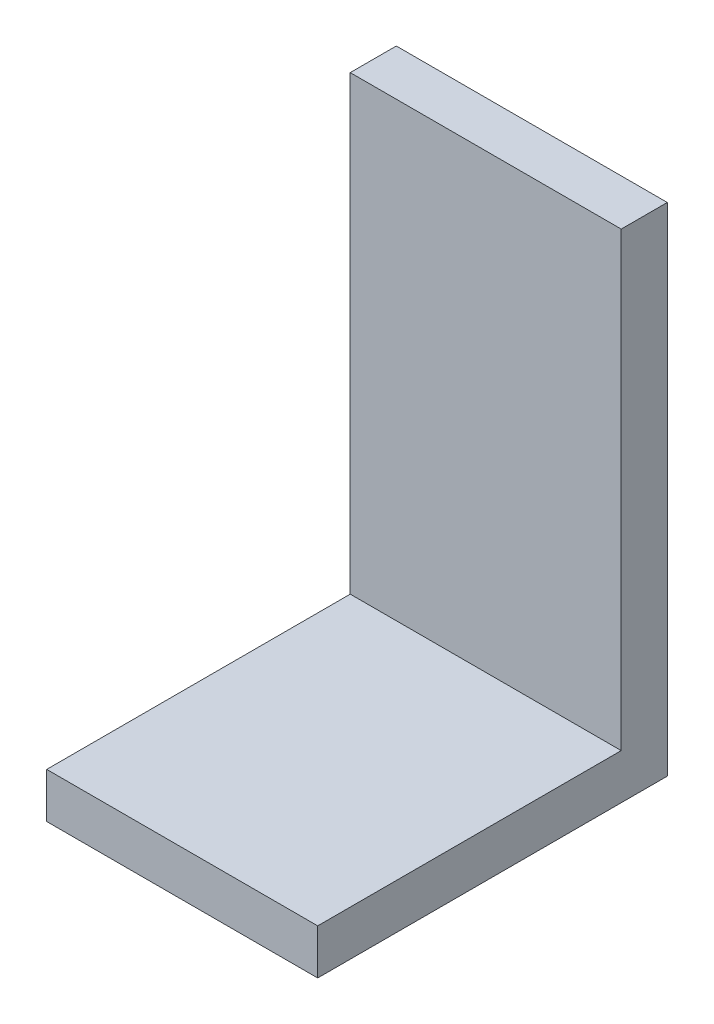
ISO-10303-21;
HEADER;
FILE_DESCRIPTION(('STEP AP214'),'2;1');
FILE_NAME('part.step','',(''),(''),'','','');
FILE_SCHEMA(('AUTOMOTIVE_DESIGN { 1 0 10303 214 1 1 1 1 }'));
ENDSEC;
DATA;
#1=APPLICATION_CONTEXT('core data for automotive mechanical design processes');
#2=APPLICATION_PROTOCOL_DEFINITION('international standard','automotive_design',2000,#1);
#3=PRODUCT_CONTEXT('',#1,'mechanical');
#4=PRODUCT('Part','Part','',(#3));
#5=PRODUCT_RELATED_PRODUCT_CATEGORY('part','',(#4));
#6=PRODUCT_DEFINITION_FORMATION('','',#4);
#7=PRODUCT_DEFINITION_CONTEXT('part definition',#1,'design');
#8=PRODUCT_DEFINITION('design','',#6,#7);
#9=PRODUCT_DEFINITION_SHAPE('','',#8);
#10=(LENGTH_UNIT() NAMED_UNIT(*) SI_UNIT(.MILLI.,.METRE.));
#11=(NAMED_UNIT(*) PLANE_ANGLE_UNIT() SI_UNIT($,.RADIAN.));
#12=(NAMED_UNIT(*) SI_UNIT($,.STERADIAN.) SOLID_ANGLE_UNIT());
#13=UNCERTAINTY_MEASURE_WITH_UNIT(LENGTH_MEASURE(1.E-05),#10,'distance_accuracy_value','');
#14=(GEOMETRIC_REPRESENTATION_CONTEXT(3) GLOBAL_UNCERTAINTY_ASSIGNED_CONTEXT((#13)) GLOBAL_UNIT_ASSIGNED_CONTEXT((#10,
#11,#12)) REPRESENTATION_CONTEXT('',''));
#15=CARTESIAN_POINT('',(0.,0.,0.));
#16=DIRECTION('',(0.,0.,1.));
#17=DIRECTION('',(1.,0.,0.));
#18=AXIS2_PLACEMENT_3D('',#15,#16,#17);
#19=CARTESIAN_POINT('',(-0.1,-4.55,0.));
#20=DIRECTION('',(1.,0.,0.));
#21=DIRECTION('',(0.,0.,1.));
#22=AXIS2_PLACEMENT_3D('',#19,#20,#21);
#23=PLANE('',#22);
#24=DIRECTION('',(0.,-1.,0.));
#25=VECTOR('',#24,1.);
#26=CARTESIAN_POINT('',(-0.1,-4.,0.));
#27=LINE('',#26,#25);
#28=CARTESIAN_POINT('',(-0.1,-4.,0.));
#29=VERTEX_POINT('',#28);
#30=CARTESIAN_POINT('',(-0.1,-4.55,0.));
#31=VERTEX_POINT('',#30);
#32=EDGE_CURVE('E11',#29,#31,#27,.T.);
#33=ORIENTED_EDGE('',*,*,#32,.F.);
#34=DIRECTION('',(0.,0.,-1.));
#35=VECTOR('',#34,1.);
#36=CARTESIAN_POINT('',(-0.1,-4.,0.051));
#37=LINE('',#36,#35);
#38=CARTESIAN_POINT('',(-0.1,-4.,0.051));
#39=VERTEX_POINT('',#38);
#40=EDGE_CURVE('E24',#39,#29,#37,.T.);
#41=ORIENTED_EDGE('',*,*,#40,.F.);
#42=DIRECTION('',(0.,1.,0.));
#43=VECTOR('',#42,1.);
#44=CARTESIAN_POINT('',(-0.1,-4.5,0.051));
#45=LINE('',#44,#43);
#46=CARTESIAN_POINT('',(-0.1,-4.5,0.051));
#47=VERTEX_POINT('',#46);
#48=EDGE_CURVE('E87',#47,#39,#45,.T.);
#49=ORIENTED_EDGE('',*,*,#48,.F.);
#50=DIRECTION('',(0.,0.,-1.));
#51=VECTOR('',#50,1.);
#52=CARTESIAN_POINT('',(-0.1,-4.5,0.387));
#53=LINE('',#52,#51);
#54=CARTESIAN_POINT('',(-0.1,-4.5,0.387));
#55=VERTEX_POINT('',#54);
#56=EDGE_CURVE('E114',#55,#47,#53,.T.);
#57=ORIENTED_EDGE('',*,*,#56,.F.);
#58=DIRECTION('',(0.,1.,0.));
#59=VECTOR('',#58,1.);
#60=CARTESIAN_POINT('',(-0.1,-4.55,0.387));
#61=LINE('',#60,#59);
#62=CARTESIAN_POINT('',(-0.1,-4.55,0.387));
#63=VERTEX_POINT('',#62);
#64=EDGE_CURVE('E111',#63,#55,#61,.T.);
#65=ORIENTED_EDGE('',*,*,#64,.F.);
#66=DIRECTION('',(0.,0.,1.));
#67=VECTOR('',#66,1.);
#68=CARTESIAN_POINT('',(-0.1,-4.55,0.));
#69=LINE('',#68,#67);
#70=EDGE_CURVE('E108',#31,#63,#69,.T.);
#71=ORIENTED_EDGE('',*,*,#70,.F.);
#72=EDGE_LOOP('',(#33,#41,#49,#57,#65,#71));
#73=FACE_BOUND('',#72,.T.);
#74=ADVANCED_FACE('F17',(#73),#23,.T.);
#75=CARTESIAN_POINT('',(-0.4,-4.,0.));
#76=DIRECTION('',(-1.,0.,0.));
#77=DIRECTION('',(0.,0.,1.));
#78=AXIS2_PLACEMENT_3D('',#75,#76,#77);
#79=PLANE('',#78);
#80=DIRECTION('',(0.,1.,0.));
#81=VECTOR('',#80,1.);
#82=CARTESIAN_POINT('',(-0.4,-4.55,0.));
#83=LINE('',#82,#81);
#84=CARTESIAN_POINT('',(-0.4,-4.55,0.));
#85=VERTEX_POINT('',#84);
#86=CARTESIAN_POINT('',(-0.4,-4.,0.));
#87=VERTEX_POINT('',#86);
#88=EDGE_CURVE('E106',#85,#87,#83,.T.);
#89=ORIENTED_EDGE('',*,*,#88,.F.);
#90=DIRECTION('',(0.,0.,-1.));
#91=VECTOR('',#90,1.);
#92=CARTESIAN_POINT('',(-0.4,-4.55,0.387));
#93=LINE('',#92,#91);
#94=CARTESIAN_POINT('',(-0.4,-4.55,0.387));
#95=VERTEX_POINT('',#94);
#96=EDGE_CURVE('E103',#95,#85,#93,.T.);
#97=ORIENTED_EDGE('',*,*,#96,.F.);
#98=DIRECTION('',(0.,-1.,0.));
#99=VECTOR('',#98,1.);
#100=CARTESIAN_POINT('',(-0.4,-4.5,0.387));
#101=LINE('',#100,#99);
#102=CARTESIAN_POINT('',(-0.4,-4.5,0.387));
#103=VERTEX_POINT('',#102);
#104=EDGE_CURVE('E100',#103,#95,#101,.T.);
#105=ORIENTED_EDGE('',*,*,#104,.F.);
#106=DIRECTION('',(0.,0.,1.));
#107=VECTOR('',#106,1.);
#108=CARTESIAN_POINT('',(-0.4,-4.5,0.051));
#109=LINE('',#108,#107);
#110=CARTESIAN_POINT('',(-0.4,-4.5,0.051));
#111=VERTEX_POINT('',#110);
#112=EDGE_CURVE('E72',#111,#103,#109,.T.);
#113=ORIENTED_EDGE('',*,*,#112,.F.);
#114=DIRECTION('',(0.,-1.,0.));
#115=VECTOR('',#114,1.);
#116=CARTESIAN_POINT('',(-0.4,-4.,0.051));
#117=LINE('',#116,#115);
#118=CARTESIAN_POINT('',(-0.4,-4.,0.051));
#119=VERTEX_POINT('',#118);
#120=EDGE_CURVE('E66',#119,#111,#117,.T.);
#121=ORIENTED_EDGE('',*,*,#120,.F.);
#122=DIRECTION('',(0.,0.,1.));
#123=VECTOR('',#122,1.);
#124=CARTESIAN_POINT('',(-0.4,-4.,0.));
#125=LINE('',#124,#123);
#126=EDGE_CURVE('E69',#87,#119,#125,.T.);
#127=ORIENTED_EDGE('',*,*,#126,.F.);
#128=EDGE_LOOP('',(#89,#97,#105,#113,#121,#127));
#129=FACE_BOUND('',#128,.T.);
#130=ADVANCED_FACE('F68',(#129),#79,.T.);
#131=CARTESIAN_POINT('',(-0.1,-4.55,0.387));
#132=DIRECTION('',(0.,0.,1.));
#133=DIRECTION('',(0.,1.,0.));
#134=AXIS2_PLACEMENT_3D('',#131,#132,#133);
#135=PLANE('',#134);
#136=ORIENTED_EDGE('',*,*,#64,.T.);
#137=DIRECTION('',(1.,0.,0.));
#138=VECTOR('',#137,1.);
#139=CARTESIAN_POINT('',(-0.4,-4.5,0.387));
#140=LINE('',#139,#138);
#141=EDGE_CURVE('E83',#103,#55,#140,.T.);
#142=ORIENTED_EDGE('',*,*,#141,.F.);
#143=ORIENTED_EDGE('',*,*,#104,.T.);
#144=DIRECTION('',(-1.,0.,0.));
#145=VECTOR('',#144,1.);
#146=CARTESIAN_POINT('',(-0.1,-4.55,0.387));
#147=LINE('',#146,#145);
#148=EDGE_CURVE('E88',#63,#95,#147,.T.);
#149=ORIENTED_EDGE('',*,*,#148,.F.);
#150=EDGE_LOOP('',(#136,#142,#143,#149));
#151=FACE_BOUND('',#150,.T.);
#152=ADVANCED_FACE('F125',(#151),#135,.T.);
#153=CARTESIAN_POINT('',(-0.1,-4.5,0.051));
#154=DIRECTION('',(0.,0.,1.));
#155=DIRECTION('',(0.,1.,0.));
#156=AXIS2_PLACEMENT_3D('',#153,#154,#155);
#157=PLANE('',#156);
#158=ORIENTED_EDGE('',*,*,#48,.T.);
#159=DIRECTION('',(1.,0.,0.));
#160=VECTOR('',#159,1.);
#161=CARTESIAN_POINT('',(-0.4,-4.,0.051));
#162=LINE('',#161,#160);
#163=EDGE_CURVE('E81',#119,#39,#162,.T.);
#164=ORIENTED_EDGE('',*,*,#163,.F.);
#165=ORIENTED_EDGE('',*,*,#120,.T.);
#166=DIRECTION('',(-1.,0.,0.));
#167=VECTOR('',#166,1.);
#168=CARTESIAN_POINT('',(-0.1,-4.5,0.051));
#169=LINE('',#168,#167);
#170=EDGE_CURVE('E89',#47,#111,#169,.T.);
#171=ORIENTED_EDGE('',*,*,#170,.F.);
#172=EDGE_LOOP('',(#158,#164,#165,#171));
#173=FACE_BOUND('',#172,.T.);
#174=ADVANCED_FACE('F86',(#173),#157,.T.);
#175=CARTESIAN_POINT('',(-0.4,-4.55,0.));
#176=DIRECTION('',(0.,-1.,0.));
#177=DIRECTION('',(0.,0.,1.));
#178=AXIS2_PLACEMENT_3D('',#175,#176,#177);
#179=PLANE('',#178);
#180=DIRECTION('',(-1.,0.,0.));
#181=VECTOR('',#180,1.);
#182=CARTESIAN_POINT('',(-0.1,-4.55,0.));
#183=LINE('',#182,#181);
#184=EDGE_CURVE('E93',#31,#85,#183,.T.);
#185=ORIENTED_EDGE('',*,*,#184,.F.);
#186=ORIENTED_EDGE('',*,*,#70,.T.);
#187=ORIENTED_EDGE('',*,*,#148,.T.);
#188=ORIENTED_EDGE('',*,*,#96,.T.);
#189=EDGE_LOOP('',(#185,#186,#187,#188));
#190=FACE_BOUND('',#189,.T.);
#191=ADVANCED_FACE('F121',(#190),#179,.T.);
#192=CARTESIAN_POINT('',(-0.1,-4.,0.));
#193=DIRECTION('',(0.,1.,0.));
#194=DIRECTION('',(0.,0.,1.));
#195=AXIS2_PLACEMENT_3D('',#192,#193,#194);
#196=PLANE('',#195);
#197=DIRECTION('',(1.,0.,0.));
#198=VECTOR('',#197,1.);
#199=CARTESIAN_POINT('',(-0.4,-4.,0.));
#200=LINE('',#199,#198);
#201=EDGE_CURVE('E82',#87,#29,#200,.T.);
#202=ORIENTED_EDGE('',*,*,#201,.F.);
#203=ORIENTED_EDGE('',*,*,#126,.T.);
#204=ORIENTED_EDGE('',*,*,#163,.T.);
#205=ORIENTED_EDGE('',*,*,#40,.T.);
#206=EDGE_LOOP('',(#202,#203,#204,#205));
#207=FACE_BOUND('',#206,.T.);
#208=ADVANCED_FACE('F80',(#207),#196,.T.);
#209=CARTESIAN_POINT('',(-0.1,-4.5,0.051));
#210=DIRECTION('',(0.,1.,0.));
#211=DIRECTION('',(0.,0.,1.));
#212=AXIS2_PLACEMENT_3D('',#209,#210,#211);
#213=PLANE('',#212);
#214=ORIENTED_EDGE('',*,*,#170,.T.);
#215=ORIENTED_EDGE('',*,*,#112,.T.);
#216=ORIENTED_EDGE('',*,*,#141,.T.);
#217=ORIENTED_EDGE('',*,*,#56,.T.);
#218=EDGE_LOOP('',(#214,#215,#216,#217));
#219=FACE_BOUND('',#218,.T.);
#220=ADVANCED_FACE('F127',(#219),#213,.T.);
#221=CARTESIAN_POINT('',(-0.4,-4.55,0.));
#222=DIRECTION('',(0.,0.,-1.));
#223=DIRECTION('',(0.,1.,0.));
#224=AXIS2_PLACEMENT_3D('',#221,#222,#223);
#225=PLANE('',#224);
#226=ORIENTED_EDGE('',*,*,#88,.T.);
#227=ORIENTED_EDGE('',*,*,#201,.T.);
#228=ORIENTED_EDGE('',*,*,#32,.T.);
#229=ORIENTED_EDGE('',*,*,#184,.T.);
#230=EDGE_LOOP('',(#226,#227,#228,#229));
#231=FACE_BOUND('',#230,.T.);
#232=ADVANCED_FACE('F117',(#231),#225,.T.);
#233=CLOSED_SHELL('',(#74,#130,#152,#174,#191,#208,#220,#232));
#234=MANIFOLD_SOLID_BREP('B1',#233);
#235=ADVANCED_BREP_SHAPE_REPRESENTATION('',(#18,#234),#14);
#236=SHAPE_DEFINITION_REPRESENTATION(#9,#235);
ENDSEC;
END-ISO-10303-21;
